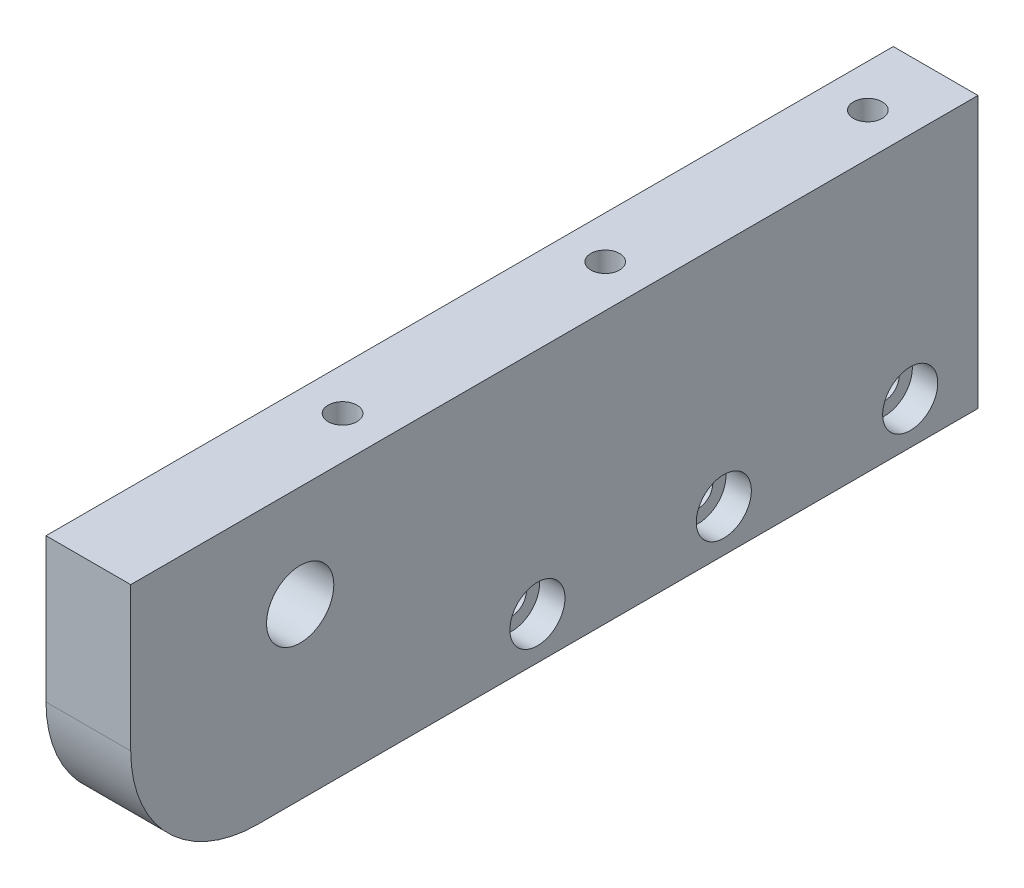
ISO-10303-21;
HEADER;
FILE_DESCRIPTION(('STEP AP214'),'2;1');
FILE_NAME('part.step','',(''),(''),'','','');
FILE_SCHEMA(('AUTOMOTIVE_DESIGN { 1 0 10303 214 1 1 1 1 }'));
ENDSEC;
DATA;
#1=APPLICATION_CONTEXT('core data for automotive mechanical design processes');
#2=APPLICATION_PROTOCOL_DEFINITION('international standard','automotive_design',2000,#1);
#3=PRODUCT_CONTEXT('',#1,'mechanical');
#4=PRODUCT('Part','Part','',(#3));
#5=PRODUCT_RELATED_PRODUCT_CATEGORY('part','',(#4));
#6=PRODUCT_DEFINITION_FORMATION('','',#4);
#7=PRODUCT_DEFINITION_CONTEXT('part definition',#1,'design');
#8=PRODUCT_DEFINITION('design','',#6,#7);
#9=PRODUCT_DEFINITION_SHAPE('','',#8);
#10=(LENGTH_UNIT() NAMED_UNIT(*) SI_UNIT(.MILLI.,.METRE.));
#11=(NAMED_UNIT(*) PLANE_ANGLE_UNIT() SI_UNIT($,.RADIAN.));
#12=(NAMED_UNIT(*) SI_UNIT($,.STERADIAN.) SOLID_ANGLE_UNIT());
#13=UNCERTAINTY_MEASURE_WITH_UNIT(LENGTH_MEASURE(1.E-05),#10,'distance_accuracy_value','');
#14=(GEOMETRIC_REPRESENTATION_CONTEXT(3) GLOBAL_UNCERTAINTY_ASSIGNED_CONTEXT((#13)) GLOBAL_UNIT_ASSIGNED_CONTEXT((#10,
#11,#12)) REPRESENTATION_CONTEXT('',''));
#15=CARTESIAN_POINT('',(0.,0.,0.));
#16=DIRECTION('',(0.,0.,1.));
#17=DIRECTION('',(1.,0.,0.));
#18=AXIS2_PLACEMENT_3D('',#15,#16,#17);
#19=CARTESIAN_POINT('',(10.,-16.,0.));
#20=DIRECTION('',(0.,1.,0.));
#21=DIRECTION('',(0.,0.,1.));
#22=AXIS2_PLACEMENT_3D('',#19,#20,#21);
#23=PLANE('',#22);
#24=DIRECTION('',(0.,0.,-1.));
#25=VECTOR('',#24,1.);
#26=CARTESIAN_POINT('',(10.,-16.,0.));
#27=LINE('',#26,#25);
#28=CARTESIAN_POINT('',(10.,-16.,35.));
#29=VERTEX_POINT('',#28);
#30=CARTESIAN_POINT('',(10.,-16.,-50.));
#31=VERTEX_POINT('',#30);
#32=EDGE_CURVE('E127',#29,#31,#27,.T.);
#33=ORIENTED_EDGE('',*,*,#32,.F.);
#34=DIRECTION('',(-1.,0.,0.));
#35=VECTOR('',#34,1.);
#36=CARTESIAN_POINT('',(0.,-16.,35.));
#37=LINE('',#36,#35);
#38=CARTESIAN_POINT('',(0.,-16.,35.));
#39=VERTEX_POINT('',#38);
#40=EDGE_CURVE('E157',#29,#39,#37,.T.);
#41=ORIENTED_EDGE('',*,*,#40,.T.);
#42=DIRECTION('',(0.,0.,-1.));
#43=VECTOR('',#42,1.);
#44=CARTESIAN_POINT('',(0.,-16.,0.));
#45=LINE('',#44,#43);
#46=CARTESIAN_POINT('',(0.,-16.,-50.));
#47=VERTEX_POINT('',#46);
#48=EDGE_CURVE('E141',#39,#47,#45,.T.);
#49=ORIENTED_EDGE('',*,*,#48,.T.);
#50=DIRECTION('',(-1.,0.,0.));
#51=VECTOR('',#50,1.);
#52=CARTESIAN_POINT('',(10.,-16.,-50.));
#53=LINE('',#52,#51);
#54=EDGE_CURVE('E154',#31,#47,#53,.T.);
#55=ORIENTED_EDGE('',*,*,#54,.F.);
#56=EDGE_LOOP('',(#33,#41,#49,#55));
#57=FACE_BOUND('',#56,.T.);
#58=ADVANCED_FACE('F41',(#57),#23,.F.);
#59=CARTESIAN_POINT('',(10.,0.,-50.));
#60=DIRECTION('',(0.,0.,1.));
#61=DIRECTION('',(1.,0.,0.));
#62=AXIS2_PLACEMENT_3D('',#59,#60,#61);
#63=PLANE('',#62);
#64=DIRECTION('',(0.,1.,0.));
#65=VECTOR('',#64,1.);
#66=CARTESIAN_POINT('',(0.,0.,-50.));
#67=LINE('',#66,#65);
#68=CARTESIAN_POINT('',(0.,16.,-50.));
#69=VERTEX_POINT('',#68);
#70=EDGE_CURVE('E143',#47,#69,#67,.T.);
#71=ORIENTED_EDGE('',*,*,#70,.T.);
#72=DIRECTION('',(-1.,0.,0.));
#73=VECTOR('',#72,1.);
#74=CARTESIAN_POINT('',(10.,16.,-50.));
#75=LINE('',#74,#73);
#76=CARTESIAN_POINT('',(10.,16.,-50.));
#77=VERTEX_POINT('',#76);
#78=EDGE_CURVE('E152',#77,#69,#75,.T.);
#79=ORIENTED_EDGE('',*,*,#78,.F.);
#80=DIRECTION('',(0.,1.,0.));
#81=VECTOR('',#80,1.);
#82=CARTESIAN_POINT('',(10.,0.,-50.));
#83=LINE('',#82,#81);
#84=EDGE_CURVE('E130',#31,#77,#83,.T.);
#85=ORIENTED_EDGE('',*,*,#84,.F.);
#86=ORIENTED_EDGE('',*,*,#54,.T.);
#87=EDGE_LOOP('',(#71,#79,#85,#86));
#88=FACE_BOUND('',#87,.T.);
#89=ADVANCED_FACE('F205',(#88),#63,.F.);
#90=CARTESIAN_POINT('',(10.,16.,0.));
#91=DIRECTION('',(0.,1.,0.));
#92=DIRECTION('',(0.,0.,1.));
#93=AXIS2_PLACEMENT_3D('',#90,#91,#92);
#94=PLANE('',#93);
#95=CARTESIAN_POINT('',(5.,16.,-42.));
#96=DIRECTION('',(0.,1.,0.));
#97=DIRECTION('',(0.,0.,1.));
#98=AXIS2_PLACEMENT_3D('',#95,#96,#97);
#99=CIRCLE('',#98,1.7);
#100=CARTESIAN_POINT('',(5.,16.,-40.3));
#101=VERTEX_POINT('',#100);
#102=EDGE_CURVE('E105',#101,#101,#99,.T.);
#103=ORIENTED_EDGE('',*,*,#102,.F.);
#104=EDGE_LOOP('',(#103));
#105=FACE_BOUND('',#104,.T.);
#106=CARTESIAN_POINT('',(5.,16.,20.));
#107=DIRECTION('',(0.,1.,0.));
#108=DIRECTION('',(0.,0.,1.));
#109=AXIS2_PLACEMENT_3D('',#106,#107,#108);
#110=CIRCLE('',#109,1.7);
#111=CARTESIAN_POINT('',(5.,16.,21.7));
#112=VERTEX_POINT('',#111);
#113=EDGE_CURVE('E119',#112,#112,#110,.T.);
#114=ORIENTED_EDGE('',*,*,#113,.F.);
#115=EDGE_LOOP('',(#114));
#116=FACE_BOUND('',#115,.T.);
#117=CARTESIAN_POINT('',(5.,16.,-10.9999999999999));
#118=DIRECTION('',(0.,1.,0.));
#119=DIRECTION('',(0.,0.,1.));
#120=AXIS2_PLACEMENT_3D('',#117,#118,#119);
#121=CIRCLE('',#120,1.7);
#122=CARTESIAN_POINT('',(5.,16.,-9.2999999999999));
#123=VERTEX_POINT('',#122);
#124=EDGE_CURVE('E123',#123,#123,#121,.T.);
#125=ORIENTED_EDGE('',*,*,#124,.F.);
#126=EDGE_LOOP('',(#125));
#127=FACE_BOUND('',#126,.T.);
#128=DIRECTION('',(0.,0.,-1.));
#129=VECTOR('',#128,1.);
#130=CARTESIAN_POINT('',(0.,16.,0.));
#131=LINE('',#130,#129);
#132=CARTESIAN_POINT('',(0.,16.,50.));
#133=VERTEX_POINT('',#132);
#134=EDGE_CURVE('E146',#133,#69,#131,.T.);
#135=ORIENTED_EDGE('',*,*,#134,.F.);
#136=DIRECTION('',(-1.,0.,0.));
#137=VECTOR('',#136,1.);
#138=CARTESIAN_POINT('',(10.,16.,50.));
#139=LINE('',#138,#137);
#140=CARTESIAN_POINT('',(10.,16.,50.));
#141=VERTEX_POINT('',#140);
#142=EDGE_CURVE('E137',#141,#133,#139,.T.);
#143=ORIENTED_EDGE('',*,*,#142,.F.);
#144=DIRECTION('',(0.,0.,-1.));
#145=VECTOR('',#144,1.);
#146=CARTESIAN_POINT('',(10.,16.,0.));
#147=LINE('',#146,#145);
#148=EDGE_CURVE('E132',#141,#77,#147,.T.);
#149=ORIENTED_EDGE('',*,*,#148,.T.);
#150=ORIENTED_EDGE('',*,*,#78,.T.);
#151=EDGE_LOOP('',(#135,#143,#149,#150));
#152=FACE_BOUND('',#151,.T.);
#153=ADVANCED_FACE('F213',(#105,#116,#127,#152),#94,.T.);
#154=CARTESIAN_POINT('',(10.,4.,30.));
#155=DIRECTION('',(-1.,0.,0.));
#156=DIRECTION('',(0.,0.,1.));
#157=AXIS2_PLACEMENT_3D('',#154,#155,#156);
#158=CYLINDRICAL_SURFACE('',#157,3.96875);
#159=CARTESIAN_POINT('',(10.,4.,30.));
#160=DIRECTION('',(1.,0.,0.));
#161=DIRECTION('',(0.,0.,-1.));
#162=AXIS2_PLACEMENT_3D('',#159,#160,#161);
#163=CIRCLE('',#162,3.96875);
#164=CARTESIAN_POINT('',(10.,4.,26.03125));
#165=VERTEX_POINT('',#164);
#166=EDGE_CURVE('E124',#165,#165,#163,.T.);
#167=ORIENTED_EDGE('',*,*,#166,.T.);
#168=EDGE_LOOP('',(#167));
#169=FACE_BOUND('',#168,.T.);
#170=CARTESIAN_POINT('',(0.,4.,30.));
#171=DIRECTION('',(1.,0.,0.));
#172=DIRECTION('',(0.,0.,-1.));
#173=AXIS2_PLACEMENT_3D('',#170,#171,#172);
#174=CIRCLE('',#173,3.96875);
#175=CARTESIAN_POINT('',(0.,4.,26.03125));
#176=VERTEX_POINT('',#175);
#177=EDGE_CURVE('E138',#176,#176,#174,.T.);
#178=ORIENTED_EDGE('',*,*,#177,.F.);
#179=EDGE_LOOP('',(#178));
#180=FACE_BOUND('',#179,.T.);
#181=ADVANCED_FACE('F218',(#169,#180),#158,.F.);
#182=CARTESIAN_POINT('',(10.,0.,50.));
#183=DIRECTION('',(0.,0.,1.));
#184=DIRECTION('',(1.,0.,0.));
#185=AXIS2_PLACEMENT_3D('',#182,#183,#184);
#186=PLANE('',#185);
#187=DIRECTION('',(0.,1.,0.));
#188=VECTOR('',#187,1.);
#189=CARTESIAN_POINT('',(0.,0.,50.));
#190=LINE('',#189,#188);
#191=CARTESIAN_POINT('',(0.,-1.,50.));
#192=VERTEX_POINT('',#191);
#193=EDGE_CURVE('E128',#192,#133,#190,.T.);
#194=ORIENTED_EDGE('',*,*,#193,.F.);
#195=DIRECTION('',(-1.,0.,0.));
#196=VECTOR('',#195,1.);
#197=CARTESIAN_POINT('',(10.,-1.,50.));
#198=LINE('',#197,#196);
#199=CARTESIAN_POINT('',(10.,-1.,50.));
#200=VERTEX_POINT('',#199);
#201=EDGE_CURVE('E50',#192,#200,#198,.F.);
#202=ORIENTED_EDGE('',*,*,#201,.T.);
#203=DIRECTION('',(0.,1.,0.));
#204=VECTOR('',#203,1.);
#205=CARTESIAN_POINT('',(10.,0.,50.));
#206=LINE('',#205,#204);
#207=EDGE_CURVE('E135',#200,#141,#206,.T.);
#208=ORIENTED_EDGE('',*,*,#207,.T.);
#209=ORIENTED_EDGE('',*,*,#142,.T.);
#210=EDGE_LOOP('',(#194,#202,#208,#209));
#211=FACE_BOUND('',#210,.T.);
#212=ADVANCED_FACE('F219',(#211),#186,.T.);
#213=CARTESIAN_POINT('',(10.,0.,0.));
#214=DIRECTION('',(1.,0.,0.));
#215=DIRECTION('',(0.,0.,-1.));
#216=AXIS2_PLACEMENT_3D('',#213,#214,#215);
#217=PLANE('',#216);
#218=CARTESIAN_POINT('',(10.,-11.,-42.));
#219=DIRECTION('',(1.,0.,0.));
#220=DIRECTION('',(0.,0.,-1.));
#221=AXIS2_PLACEMENT_3D('',#218,#219,#220);
#222=CIRCLE('',#221,3.25);
#223=CARTESIAN_POINT('',(10.,-11.,-45.25));
#224=VERTEX_POINT('',#223);
#225=EDGE_CURVE('E429',#224,#224,#222,.T.);
#226=ORIENTED_EDGE('',*,*,#225,.F.);
#227=EDGE_LOOP('',(#226));
#228=FACE_BOUND('',#227,.T.);
#229=CARTESIAN_POINT('',(10.,-11.,2.));
#230=DIRECTION('',(1.,0.,0.));
#231=DIRECTION('',(0.,0.,-1.));
#232=AXIS2_PLACEMENT_3D('',#229,#230,#231);
#233=CIRCLE('',#232,3.25);
#234=CARTESIAN_POINT('',(10.,-11.,-1.24999999999999));
#235=VERTEX_POINT('',#234);
#236=EDGE_CURVE('E180',#235,#235,#233,.T.);
#237=ORIENTED_EDGE('',*,*,#236,.F.);
#238=EDGE_LOOP('',(#237));
#239=FACE_BOUND('',#238,.T.);
#240=CARTESIAN_POINT('',(10.,-11.,-20.));
#241=DIRECTION('',(1.,0.,0.));
#242=DIRECTION('',(0.,0.,-1.));
#243=AXIS2_PLACEMENT_3D('',#240,#241,#242);
#244=CIRCLE('',#243,3.25);
#245=CARTESIAN_POINT('',(10.,-11.,-23.25));
#246=VERTEX_POINT('',#245);
#247=EDGE_CURVE('E167',#246,#246,#244,.T.);
#248=ORIENTED_EDGE('',*,*,#247,.F.);
#249=EDGE_LOOP('',(#248));
#250=FACE_BOUND('',#249,.T.);
#251=ORIENTED_EDGE('',*,*,#166,.F.);
#252=EDGE_LOOP('',(#251));
#253=FACE_BOUND('',#252,.T.);
#254=ORIENTED_EDGE('',*,*,#207,.F.);
#255=CARTESIAN_POINT('',(10.,-1.,35.));
#256=DIRECTION('',(1.,0.,0.));
#257=DIRECTION('',(0.,0.,-1.));
#258=AXIS2_PLACEMENT_3D('',#255,#256,#257);
#259=CIRCLE('',#258,15.);
#260=EDGE_CURVE('E11',#200,#29,#259,.T.);
#261=ORIENTED_EDGE('',*,*,#260,.T.);
#262=ORIENTED_EDGE('',*,*,#32,.T.);
#263=ORIENTED_EDGE('',*,*,#84,.T.);
#264=ORIENTED_EDGE('',*,*,#148,.F.);
#265=EDGE_LOOP('',(#254,#261,#262,#263,#264));
#266=FACE_BOUND('',#265,.T.);
#267=ADVANCED_FACE('F223',(#228,#239,#250,#253,#266),#217,.T.);
#268=CARTESIAN_POINT('',(0.,0.,0.));
#269=DIRECTION('',(1.,0.,0.));
#270=DIRECTION('',(0.,0.,-1.));
#271=AXIS2_PLACEMENT_3D('',#268,#269,#270);
#272=PLANE('',#271);
#273=CARTESIAN_POINT('',(0.,-11.,-42.));
#274=DIRECTION('',(1.,0.,0.));
#275=DIRECTION('',(0.,0.,-1.));
#276=AXIS2_PLACEMENT_3D('',#273,#274,#275);
#277=CIRCLE('',#276,1.69999999999999);
#278=CARTESIAN_POINT('',(0.,-11.,-43.7));
#279=VERTEX_POINT('',#278);
#280=EDGE_CURVE('E45',#279,#279,#277,.T.);
#281=ORIENTED_EDGE('',*,*,#280,.T.);
#282=EDGE_LOOP('',(#281));
#283=FACE_BOUND('',#282,.T.);
#284=CARTESIAN_POINT('',(0.,-11.,2.));
#285=DIRECTION('',(1.,0.,0.));
#286=DIRECTION('',(0.,0.,-1.));
#287=AXIS2_PLACEMENT_3D('',#284,#285,#286);
#288=CIRCLE('',#287,1.69999999999999);
#289=CARTESIAN_POINT('',(0.,-11.,0.300000000000008));
#290=VERTEX_POINT('',#289);
#291=EDGE_CURVE('E165',#290,#290,#288,.T.);
#292=ORIENTED_EDGE('',*,*,#291,.T.);
#293=EDGE_LOOP('',(#292));
#294=FACE_BOUND('',#293,.T.);
#295=CARTESIAN_POINT('',(0.,-11.,-20.));
#296=DIRECTION('',(1.,0.,0.));
#297=DIRECTION('',(0.,0.,-1.));
#298=AXIS2_PLACEMENT_3D('',#295,#296,#297);
#299=CIRCLE('',#298,1.69999999999999);
#300=CARTESIAN_POINT('',(0.,-11.,-21.7));
#301=VERTEX_POINT('',#300);
#302=EDGE_CURVE('E106',#301,#301,#299,.T.);
#303=ORIENTED_EDGE('',*,*,#302,.T.);
#304=EDGE_LOOP('',(#303));
#305=FACE_BOUND('',#304,.T.);
#306=ORIENTED_EDGE('',*,*,#177,.T.);
#307=EDGE_LOOP('',(#306));
#308=FACE_BOUND('',#307,.T.);
#309=ORIENTED_EDGE('',*,*,#48,.F.);
#310=CARTESIAN_POINT('',(0.,-1.,35.));
#311=DIRECTION('',(1.,0.,0.));
#312=DIRECTION('',(0.,0.,-1.));
#313=AXIS2_PLACEMENT_3D('',#310,#311,#312);
#314=CIRCLE('',#313,15.);
#315=EDGE_CURVE('E65',#39,#192,#314,.F.);
#316=ORIENTED_EDGE('',*,*,#315,.T.);
#317=ORIENTED_EDGE('',*,*,#193,.T.);
#318=ORIENTED_EDGE('',*,*,#134,.T.);
#319=ORIENTED_EDGE('',*,*,#70,.F.);
#320=EDGE_LOOP('',(#309,#316,#317,#318,#319));
#321=FACE_BOUND('',#320,.T.);
#322=ADVANCED_FACE('F231',(#283,#294,#305,#308,#321),#272,.F.);
#323=CARTESIAN_POINT('',(10.,-1.,35.));
#324=DIRECTION('',(1.,0.,0.));
#325=DIRECTION('',(0.,0.,-1.));
#326=AXIS2_PLACEMENT_3D('',#323,#324,#325);
#327=CYLINDRICAL_SURFACE('',#326,15.);
#328=ORIENTED_EDGE('',*,*,#260,.F.);
#329=ORIENTED_EDGE('',*,*,#201,.F.);
#330=ORIENTED_EDGE('',*,*,#315,.F.);
#331=ORIENTED_EDGE('',*,*,#40,.F.);
#332=EDGE_LOOP('',(#328,#329,#330,#331));
#333=FACE_BOUND('',#332,.T.);
#334=ADVANCED_FACE('F43',(#333),#327,.T.);
#335=CARTESIAN_POINT('',(5.,3.00000000000002,-10.9999999999999));
#336=DIRECTION('',(0.,1.,0.));
#337=DIRECTION('',(0.,0.,1.));
#338=AXIS2_PLACEMENT_3D('',#335,#336,#337);
#339=CONICAL_SURFACE('',#338,1.69999999999999,1.02974425867665);
#340=CARTESIAN_POINT('',(5.,1.97853694765317,-10.9999999999999));
#341=VERTEX_POINT('',#340);
#342=VERTEX_LOOP('',#341);
#343=FACE_BOUND('',#342,.T.);
#344=CARTESIAN_POINT('',(5.,3.00000000000002,-10.9999999999999));
#345=DIRECTION('',(0.,1.,0.));
#346=DIRECTION('',(0.,0.,1.));
#347=AXIS2_PLACEMENT_3D('',#344,#345,#346);
#348=CIRCLE('',#347,1.69999999999999);
#349=CARTESIAN_POINT('',(5.,3.00000000000002,-9.2999999999999));
#350=VERTEX_POINT('',#349);
#351=EDGE_CURVE('E120',#350,#350,#348,.T.);
#352=ORIENTED_EDGE('',*,*,#351,.T.);
#353=EDGE_LOOP('',(#352));
#354=FACE_BOUND('',#353,.T.);
#355=ADVANCED_FACE('F256',(#343,#354),#339,.F.);
#356=CARTESIAN_POINT('',(5.,26.,-10.9999999999999));
#357=DIRECTION('',(0.,1.,0.));
#358=DIRECTION('',(0.,0.,1.));
#359=AXIS2_PLACEMENT_3D('',#356,#357,#358);
#360=CYLINDRICAL_SURFACE('',#359,1.7);
#361=ORIENTED_EDGE('',*,*,#124,.T.);
#362=EDGE_LOOP('',(#361));
#363=FACE_BOUND('',#362,.T.);
#364=ORIENTED_EDGE('',*,*,#351,.F.);
#365=EDGE_LOOP('',(#364));
#366=FACE_BOUND('',#365,.T.);
#367=ADVANCED_FACE('F259',(#363,#366),#360,.F.);
#368=CARTESIAN_POINT('',(5.,3.00000000000002,20.));
#369=DIRECTION('',(0.,1.,0.));
#370=DIRECTION('',(0.,0.,1.));
#371=AXIS2_PLACEMENT_3D('',#368,#369,#370);
#372=CONICAL_SURFACE('',#371,1.69999999999999,1.02974425867665);
#373=CARTESIAN_POINT('',(5.,1.97853694765317,20.));
#374=VERTEX_POINT('',#373);
#375=VERTEX_LOOP('',#374);
#376=FACE_BOUND('',#375,.T.);
#377=CARTESIAN_POINT('',(5.,3.00000000000002,20.));
#378=DIRECTION('',(0.,1.,0.));
#379=DIRECTION('',(0.,0.,1.));
#380=AXIS2_PLACEMENT_3D('',#377,#378,#379);
#381=CIRCLE('',#380,1.69999999999999);
#382=CARTESIAN_POINT('',(5.,3.00000000000002,21.7));
#383=VERTEX_POINT('',#382);
#384=EDGE_CURVE('E109',#383,#383,#381,.T.);
#385=ORIENTED_EDGE('',*,*,#384,.T.);
#386=EDGE_LOOP('',(#385));
#387=FACE_BOUND('',#386,.T.);
#388=ADVANCED_FACE('F263',(#376,#387),#372,.F.);
#389=CARTESIAN_POINT('',(5.,26.,20.));
#390=DIRECTION('',(0.,1.,0.));
#391=DIRECTION('',(0.,0.,1.));
#392=AXIS2_PLACEMENT_3D('',#389,#390,#391);
#393=CYLINDRICAL_SURFACE('',#392,1.7);
#394=ORIENTED_EDGE('',*,*,#113,.T.);
#395=EDGE_LOOP('',(#394));
#396=FACE_BOUND('',#395,.T.);
#397=ORIENTED_EDGE('',*,*,#384,.F.);
#398=EDGE_LOOP('',(#397));
#399=FACE_BOUND('',#398,.T.);
#400=ADVANCED_FACE('F99',(#396,#399),#393,.F.);
#401=CARTESIAN_POINT('',(5.,3.00000000000002,-42.));
#402=DIRECTION('',(0.,1.,0.));
#403=DIRECTION('',(0.,0.,1.));
#404=AXIS2_PLACEMENT_3D('',#401,#402,#403);
#405=CONICAL_SURFACE('',#404,1.69999999999999,1.02974425867665);
#406=CARTESIAN_POINT('',(5.,1.97853694765317,-42.));
#407=VERTEX_POINT('',#406);
#408=VERTEX_LOOP('',#407);
#409=FACE_BOUND('',#408,.T.);
#410=CARTESIAN_POINT('',(5.,3.00000000000002,-42.));
#411=DIRECTION('',(0.,1.,0.));
#412=DIRECTION('',(0.,0.,1.));
#413=AXIS2_PLACEMENT_3D('',#410,#411,#412);
#414=CIRCLE('',#413,1.69999999999999);
#415=CARTESIAN_POINT('',(5.,3.00000000000002,-40.3));
#416=VERTEX_POINT('',#415);
#417=EDGE_CURVE('E103',#416,#416,#414,.T.);
#418=ORIENTED_EDGE('',*,*,#417,.T.);
#419=EDGE_LOOP('',(#418));
#420=FACE_BOUND('',#419,.T.);
#421=ADVANCED_FACE('F95',(#409,#420),#405,.F.);
#422=CARTESIAN_POINT('',(5.,26.,-42.));
#423=DIRECTION('',(0.,1.,0.));
#424=DIRECTION('',(0.,0.,1.));
#425=AXIS2_PLACEMENT_3D('',#422,#423,#424);
#426=CYLINDRICAL_SURFACE('',#425,1.7);
#427=ORIENTED_EDGE('',*,*,#102,.T.);
#428=EDGE_LOOP('',(#427));
#429=FACE_BOUND('',#428,.T.);
#430=ORIENTED_EDGE('',*,*,#417,.F.);
#431=EDGE_LOOP('',(#430));
#432=FACE_BOUND('',#431,.T.);
#433=ADVANCED_FACE('F98',(#429,#432),#426,.F.);
#434=CARTESIAN_POINT('',(10.,-11.,-20.));
#435=DIRECTION('',(1.,0.,0.));
#436=DIRECTION('',(0.,0.,-1.));
#437=AXIS2_PLACEMENT_3D('',#434,#435,#436);
#438=CYLINDRICAL_SURFACE('',#437,1.69999999999999);
#439=CARTESIAN_POINT('',(7.00000000000001,-11.,-20.));
#440=DIRECTION('',(1.,0.,0.));
#441=DIRECTION('',(0.,0.,-1.));
#442=AXIS2_PLACEMENT_3D('',#439,#440,#441);
#443=CIRCLE('',#442,1.69999999999999);
#444=CARTESIAN_POINT('',(7.00000000000001,-11.,-21.7));
#445=VERTEX_POINT('',#444);
#446=EDGE_CURVE('E112',#445,#445,#443,.T.);
#447=ORIENTED_EDGE('',*,*,#446,.T.);
#448=EDGE_LOOP('',(#447));
#449=FACE_BOUND('',#448,.T.);
#450=ORIENTED_EDGE('',*,*,#302,.F.);
#451=EDGE_LOOP('',(#450));
#452=FACE_BOUND('',#451,.T.);
#453=ADVANCED_FACE('F189',(#449,#452),#438,.F.);
#454=CARTESIAN_POINT('',(7.00000000000001,-9.30000000000001,-20.));
#455=DIRECTION('',(-1.,0.,0.));
#456=DIRECTION('',(0.,0.,1.));
#457=AXIS2_PLACEMENT_3D('',#454,#455,#456);
#458=PLANE('',#457);
#459=ORIENTED_EDGE('',*,*,#446,.F.);
#460=EDGE_LOOP('',(#459));
#461=FACE_BOUND('',#460,.T.);
#462=CARTESIAN_POINT('',(7.00000000000001,-11.,-20.));
#463=DIRECTION('',(1.,0.,0.));
#464=DIRECTION('',(0.,0.,-1.));
#465=AXIS2_PLACEMENT_3D('',#462,#463,#464);
#466=CIRCLE('',#465,3.25);
#467=CARTESIAN_POINT('',(7.00000000000001,-11.,-23.25));
#468=VERTEX_POINT('',#467);
#469=EDGE_CURVE('E172',#468,#468,#466,.T.);
#470=ORIENTED_EDGE('',*,*,#469,.T.);
#471=EDGE_LOOP('',(#470));
#472=FACE_BOUND('',#471,.T.);
#473=ADVANCED_FACE('F192',(#461,#472),#458,.F.);
#474=CARTESIAN_POINT('',(10.,-11.,-20.));
#475=DIRECTION('',(1.,0.,0.));
#476=DIRECTION('',(0.,0.,-1.));
#477=AXIS2_PLACEMENT_3D('',#474,#475,#476);
#478=CYLINDRICAL_SURFACE('',#477,3.25);
#479=ORIENTED_EDGE('',*,*,#469,.F.);
#480=EDGE_LOOP('',(#479));
#481=FACE_BOUND('',#480,.T.);
#482=ORIENTED_EDGE('',*,*,#247,.T.);
#483=EDGE_LOOP('',(#482));
#484=FACE_BOUND('',#483,.T.);
#485=ADVANCED_FACE('F194',(#481,#484),#478,.F.);
#486=CARTESIAN_POINT('',(10.,-11.,2.));
#487=DIRECTION('',(1.,0.,0.));
#488=DIRECTION('',(0.,0.,-1.));
#489=AXIS2_PLACEMENT_3D('',#486,#487,#488);
#490=CYLINDRICAL_SURFACE('',#489,1.69999999999999);
#491=CARTESIAN_POINT('',(7.00000000000001,-11.,2.));
#492=DIRECTION('',(1.,0.,0.));
#493=DIRECTION('',(0.,0.,-1.));
#494=AXIS2_PLACEMENT_3D('',#491,#492,#493);
#495=CIRCLE('',#494,1.69999999999999);
#496=CARTESIAN_POINT('',(7.00000000000001,-11.,0.300000000000007));
#497=VERTEX_POINT('',#496);
#498=EDGE_CURVE('E168',#497,#497,#495,.T.);
#499=ORIENTED_EDGE('',*,*,#498,.T.);
#500=EDGE_LOOP('',(#499));
#501=FACE_BOUND('',#500,.T.);
#502=ORIENTED_EDGE('',*,*,#291,.F.);
#503=EDGE_LOOP('',(#502));
#504=FACE_BOUND('',#503,.T.);
#505=ADVANCED_FACE('F200',(#501,#504),#490,.F.);
#506=CARTESIAN_POINT('',(7.00000000000001,-9.30000000000001,2.));
#507=DIRECTION('',(-1.,0.,0.));
#508=DIRECTION('',(0.,0.,1.));
#509=AXIS2_PLACEMENT_3D('',#506,#507,#508);
#510=PLANE('',#509);
#511=ORIENTED_EDGE('',*,*,#498,.F.);
#512=EDGE_LOOP('',(#511));
#513=FACE_BOUND('',#512,.T.);
#514=CARTESIAN_POINT('',(7.00000000000001,-11.,2.));
#515=DIRECTION('',(1.,0.,0.));
#516=DIRECTION('',(0.,0.,-1.));
#517=AXIS2_PLACEMENT_3D('',#514,#515,#516);
#518=CIRCLE('',#517,3.25);
#519=CARTESIAN_POINT('',(7.00000000000001,-11.,-1.24999999999999));
#520=VERTEX_POINT('',#519);
#521=EDGE_CURVE('E175',#520,#520,#518,.T.);
#522=ORIENTED_EDGE('',*,*,#521,.T.);
#523=EDGE_LOOP('',(#522));
#524=FACE_BOUND('',#523,.T.);
#525=ADVANCED_FACE('F372',(#513,#524),#510,.F.);
#526=CARTESIAN_POINT('',(10.,-11.,2.));
#527=DIRECTION('',(1.,0.,0.));
#528=DIRECTION('',(0.,0.,-1.));
#529=AXIS2_PLACEMENT_3D('',#526,#527,#528);
#530=CYLINDRICAL_SURFACE('',#529,3.25);
#531=ORIENTED_EDGE('',*,*,#521,.F.);
#532=EDGE_LOOP('',(#531));
#533=FACE_BOUND('',#532,.T.);
#534=ORIENTED_EDGE('',*,*,#236,.T.);
#535=EDGE_LOOP('',(#534));
#536=FACE_BOUND('',#535,.T.);
#537=ADVANCED_FACE('F381',(#533,#536),#530,.F.);
#538=CARTESIAN_POINT('',(10.,-11.,-42.));
#539=DIRECTION('',(1.,0.,0.));
#540=DIRECTION('',(0.,0.,-1.));
#541=AXIS2_PLACEMENT_3D('',#538,#539,#540);
#542=CYLINDRICAL_SURFACE('',#541,1.69999999999999);
#543=CARTESIAN_POINT('',(7.00000000000001,-11.,-42.));
#544=DIRECTION('',(1.,0.,0.));
#545=DIRECTION('',(0.,0.,-1.));
#546=AXIS2_PLACEMENT_3D('',#543,#544,#545);
#547=CIRCLE('',#546,1.69999999999999);
#548=CARTESIAN_POINT('',(7.00000000000001,-11.,-43.7));
#549=VERTEX_POINT('',#548);
#550=EDGE_CURVE('E431',#549,#549,#547,.T.);
#551=ORIENTED_EDGE('',*,*,#550,.T.);
#552=EDGE_LOOP('',(#551));
#553=FACE_BOUND('',#552,.T.);
#554=ORIENTED_EDGE('',*,*,#280,.F.);
#555=EDGE_LOOP('',(#554));
#556=FACE_BOUND('',#555,.T.);
#557=ADVANCED_FACE('F391',(#553,#556),#542,.F.);
#558=CARTESIAN_POINT('',(7.00000000000001,-9.30000000000001,-42.));
#559=DIRECTION('',(-1.,0.,0.));
#560=DIRECTION('',(0.,0.,1.));
#561=AXIS2_PLACEMENT_3D('',#558,#559,#560);
#562=PLANE('',#561);
#563=ORIENTED_EDGE('',*,*,#550,.F.);
#564=EDGE_LOOP('',(#563));
#565=FACE_BOUND('',#564,.T.);
#566=CARTESIAN_POINT('',(7.00000000000001,-11.,-42.));
#567=DIRECTION('',(1.,0.,0.));
#568=DIRECTION('',(0.,0.,-1.));
#569=AXIS2_PLACEMENT_3D('',#566,#567,#568);
#570=CIRCLE('',#569,3.25);
#571=CARTESIAN_POINT('',(7.00000000000001,-11.,-45.25));
#572=VERTEX_POINT('',#571);
#573=EDGE_CURVE('E427',#572,#572,#570,.T.);
#574=ORIENTED_EDGE('',*,*,#573,.T.);
#575=EDGE_LOOP('',(#574));
#576=FACE_BOUND('',#575,.T.);
#577=ADVANCED_FACE('F401',(#565,#576),#562,.F.);
#578=CARTESIAN_POINT('',(10.,-11.,-42.));
#579=DIRECTION('',(1.,0.,0.));
#580=DIRECTION('',(0.,0.,-1.));
#581=AXIS2_PLACEMENT_3D('',#578,#579,#580);
#582=CYLINDRICAL_SURFACE('',#581,3.25);
#583=ORIENTED_EDGE('',*,*,#573,.F.);
#584=EDGE_LOOP('',(#583));
#585=FACE_BOUND('',#584,.T.);
#586=ORIENTED_EDGE('',*,*,#225,.T.);
#587=EDGE_LOOP('',(#586));
#588=FACE_BOUND('',#587,.T.);
#589=ADVANCED_FACE('F411',(#585,#588),#582,.F.);
#590=CLOSED_SHELL('',(#58,#89,#153,#181,#212,#267,#322,#334,#355,#367,#388,#400,#421,#433,#453,
#473,#485,#505,#525,#537,#557,#577,#589));
#591=MANIFOLD_SOLID_BREP('B2',#590);
#592=ADVANCED_BREP_SHAPE_REPRESENTATION('',(#18,#591),#14);
#593=SHAPE_DEFINITION_REPRESENTATION(#9,#592);
ENDSEC;
END-ISO-10303-21;
